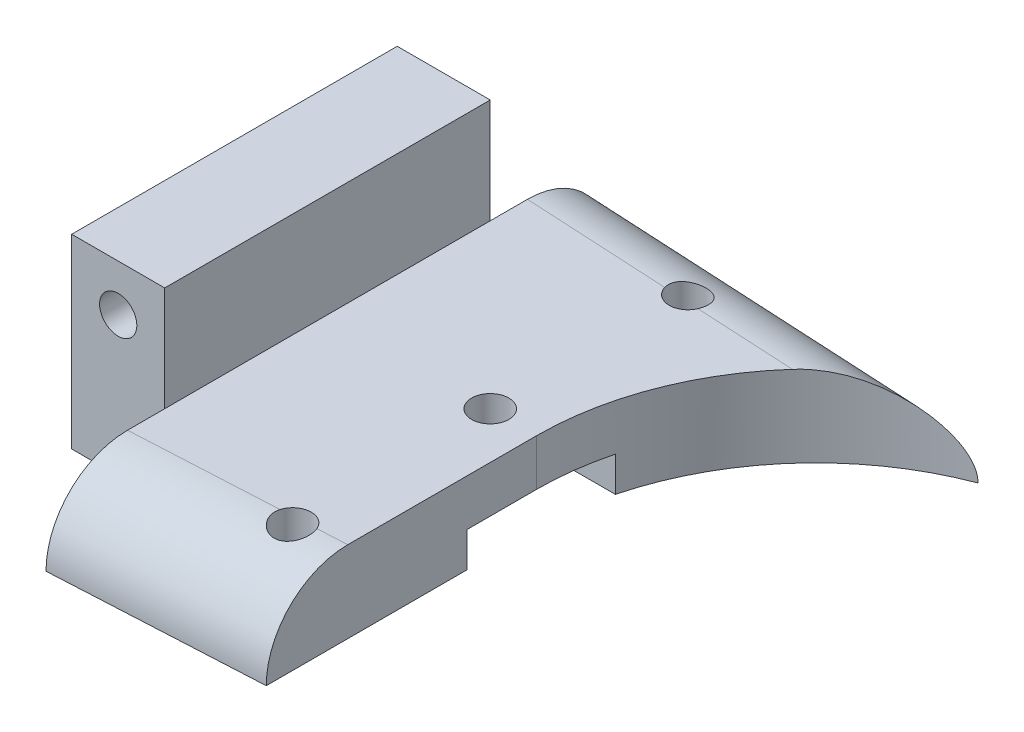
ISO-10303-21;
HEADER;
FILE_DESCRIPTION(('STEP AP214'),'2;1');
FILE_NAME('part.step','',(''),(''),'','','');
FILE_SCHEMA(('AUTOMOTIVE_DESIGN { 1 0 10303 214 1 1 1 1 }'));
ENDSEC;
DATA;
#1=APPLICATION_CONTEXT('core data for automotive mechanical design processes');
#2=APPLICATION_PROTOCOL_DEFINITION('international standard','automotive_design',2000,#1);
#3=PRODUCT_CONTEXT('',#1,'mechanical');
#4=PRODUCT('Part','Part','',(#3));
#5=PRODUCT_RELATED_PRODUCT_CATEGORY('part','',(#4));
#6=PRODUCT_DEFINITION_FORMATION('','',#4);
#7=PRODUCT_DEFINITION_CONTEXT('part definition',#1,'design');
#8=PRODUCT_DEFINITION('design','',#6,#7);
#9=PRODUCT_DEFINITION_SHAPE('','',#8);
#10=(LENGTH_UNIT() NAMED_UNIT(*) SI_UNIT(.MILLI.,.METRE.));
#11=(NAMED_UNIT(*) PLANE_ANGLE_UNIT() SI_UNIT($,.RADIAN.));
#12=(NAMED_UNIT(*) SI_UNIT($,.STERADIAN.) SOLID_ANGLE_UNIT());
#13=UNCERTAINTY_MEASURE_WITH_UNIT(LENGTH_MEASURE(1.E-05),#10,'distance_accuracy_value','');
#14=(GEOMETRIC_REPRESENTATION_CONTEXT(3) GLOBAL_UNCERTAINTY_ASSIGNED_CONTEXT((#13)) GLOBAL_UNIT_ASSIGNED_CONTEXT((#10,
#11,#12)) REPRESENTATION_CONTEXT('',''));
#15=CARTESIAN_POINT('',(0.,0.,0.));
#16=DIRECTION('',(0.,0.,1.));
#17=DIRECTION('',(1.,0.,0.));
#18=AXIS2_PLACEMENT_3D('',#15,#16,#17);
#19=CARTESIAN_POINT('',(0.,0.,0.));
#20=DIRECTION('',(0.,1.,0.));
#21=DIRECTION('',(0.,0.,1.));
#22=AXIS2_PLACEMENT_3D('',#19,#20,#21);
#23=PLANE('',#22);
#24=CARTESIAN_POINT('',(24.,0.,8.5));
#25=DIRECTION('',(0.,1.,0.));
#26=DIRECTION('',(0.,0.,1.));
#27=AXIS2_PLACEMENT_3D('',#24,#25,#26);
#28=CIRCLE('',#27,0.800000000000002);
#29=CARTESIAN_POINT('',(24.,0.,9.3));
#30=VERTEX_POINT('',#29);
#31=EDGE_CURVE('E210',#30,#30,#28,.T.);
#32=ORIENTED_EDGE('',*,*,#31,.T.);
#33=EDGE_LOOP('',(#32));
#34=FACE_BOUND('',#33,.T.);
#35=DIRECTION('',(1.,0.,0.));
#36=VECTOR('',#35,1.);
#37=CARTESIAN_POINT('',(13.,0.,3.));
#38=LINE('',#37,#36);
#39=CARTESIAN_POINT('',(13.,0.,3.));
#40=VERTEX_POINT('',#39);
#41=CARTESIAN_POINT('',(26.,0.,3.));
#42=VERTEX_POINT('',#41);
#43=EDGE_CURVE('E167',#40,#42,#38,.T.);
#44=ORIENTED_EDGE('',*,*,#43,.T.);
#45=DIRECTION('',(0.,0.,1.));
#46=VECTOR('',#45,1.);
#47=CARTESIAN_POINT('',(26.,0.,0.));
#48=LINE('',#47,#46);
#49=CARTESIAN_POINT('',(26.,0.,11.6315789473684));
#50=VERTEX_POINT('',#49);
#51=EDGE_CURVE('E229',#42,#50,#48,.T.);
#52=ORIENTED_EDGE('',*,*,#51,.T.);
#53=DIRECTION('',(0.99861782933251,0.,-0.0525588331227637));
#54=VECTOR('',#53,1.);
#55=CARTESIAN_POINT('',(0.682320441988951,0.,12.9640883977901));
#56=LINE('',#55,#54);
#57=CARTESIAN_POINT('',(17.,0.,12.1052631578947));
#58=VERTEX_POINT('',#57);
#59=EDGE_CURVE('E256',#58,#50,#56,.T.);
#60=ORIENTED_EDGE('',*,*,#59,.F.);
#61=DIRECTION('',(0.,0.,1.));
#62=VECTOR('',#61,1.);
#63=CARTESIAN_POINT('',(17.,0.,0.));
#64=LINE('',#63,#62);
#65=CARTESIAN_POINT('',(17.,0.,7.));
#66=VERTEX_POINT('',#65);
#67=EDGE_CURVE('E254',#66,#58,#64,.T.);
#68=ORIENTED_EDGE('',*,*,#67,.F.);
#69=DIRECTION('',(1.,0.,0.));
#70=VECTOR('',#69,1.);
#71=CARTESIAN_POINT('',(0.,0.,7.));
#72=LINE('',#71,#70);
#73=CARTESIAN_POINT('',(13.,0.,7.));
#74=VERTEX_POINT('',#73);
#75=EDGE_CURVE('E252',#74,#66,#72,.T.);
#76=ORIENTED_EDGE('',*,*,#75,.F.);
#77=DIRECTION('',(0.,0.,-1.));
#78=VECTOR('',#77,1.);
#79=CARTESIAN_POINT('',(13.,0.,0.));
#80=LINE('',#79,#78);
#81=EDGE_CURVE('E250',#74,#40,#80,.T.);
#82=ORIENTED_EDGE('',*,*,#81,.T.);
#83=EDGE_LOOP('',(#44,#52,#60,#68,#76,#82));
#84=FACE_BOUND('',#83,.T.);
#85=ADVANCED_FACE('F35',(#34,#84),#23,.F.);
#86=CARTESIAN_POINT('',(24.,0.,-8.5));
#87=DIRECTION('',(0.,1.,0.));
#88=DIRECTION('',(0.,0.,1.));
#89=AXIS2_PLACEMENT_3D('',#86,#87,#88);
#90=CIRCLE('',#89,0.799999999999999);
#91=CARTESIAN_POINT('',(24.,0.,-7.7));
#92=VERTEX_POINT('',#91);
#93=EDGE_CURVE('E214',#92,#92,#90,.T.);
#94=ORIENTED_EDGE('',*,*,#93,.T.);
#95=EDGE_LOOP('',(#94));
#96=FACE_BOUND('',#95,.T.);
#97=DIRECTION('',(-1.,0.,0.));
#98=VECTOR('',#97,1.);
#99=CARTESIAN_POINT('',(26.3810499613777,0.,-3.));
#100=LINE('',#99,#98);
#101=CARTESIAN_POINT('',(26.3810499613777,0.,-3.));
#102=VERTEX_POINT('',#101);
#103=CARTESIAN_POINT('',(13.,0.,-3.));
#104=VERTEX_POINT('',#103);
#105=EDGE_CURVE('E178',#102,#104,#100,.T.);
#106=ORIENTED_EDGE('',*,*,#105,.T.);
#107=CARTESIAN_POINT('',(13.,0.,-7.));
#108=VERTEX_POINT('',#107);
#109=EDGE_CURVE('E249',#104,#108,#80,.T.);
#110=ORIENTED_EDGE('',*,*,#109,.T.);
#111=DIRECTION('',(1.,0.,0.));
#112=VECTOR('',#111,1.);
#113=CARTESIAN_POINT('',(0.,0.,-7.));
#114=LINE('',#113,#112);
#115=CARTESIAN_POINT('',(17.,0.,-7.));
#116=VERTEX_POINT('',#115);
#117=EDGE_CURVE('E246',#108,#116,#114,.T.);
#118=ORIENTED_EDGE('',*,*,#117,.T.);
#119=DIRECTION('',(0.,0.,-1.));
#120=VECTOR('',#119,1.);
#121=CARTESIAN_POINT('',(17.,0.,0.));
#122=LINE('',#121,#120);
#123=CARTESIAN_POINT('',(17.,0.,-12.1052631578947));
#124=VERTEX_POINT('',#123);
#125=EDGE_CURVE('E243',#116,#124,#122,.T.);
#126=ORIENTED_EDGE('',*,*,#125,.T.);
#127=DIRECTION('',(0.99861782933251,0.,0.0525588331227638));
#128=VECTOR('',#127,1.);
#129=CARTESIAN_POINT('',(0.682320441988952,0.,-12.9640883977901));
#130=LINE('',#129,#128);
#131=CARTESIAN_POINT('',(33.7534704892804,0.,-11.2235015531958));
#132=VERTEX_POINT('',#131);
#133=EDGE_CURVE('E240',#124,#132,#130,.T.);
#134=ORIENTED_EDGE('',*,*,#133,.T.);
#135=CARTESIAN_POINT('',(38.,0.,0.));
#136=DIRECTION('',(0.,1.,0.));
#137=DIRECTION('',(0.,0.,1.));
#138=AXIS2_PLACEMENT_3D('',#135,#136,#137);
#139=CIRCLE('',#138,12.);
#140=EDGE_CURVE('E225',#132,#102,#139,.T.);
#141=ORIENTED_EDGE('',*,*,#140,.T.);
#142=EDGE_LOOP('',(#106,#110,#118,#126,#134,#141));
#143=FACE_BOUND('',#142,.T.);
#144=ADVANCED_FACE('F310',(#96,#143),#23,.F.);
#145=CARTESIAN_POINT('',(38.,3.5,0.));
#146=DIRECTION('',(0.,-1.,0.));
#147=DIRECTION('',(0.,0.,-1.));
#148=AXIS2_PLACEMENT_3D('',#145,#146,#147);
#149=CYLINDRICAL_SURFACE('',#148,12.);
#150=ORIENTED_EDGE('',*,*,#140,.F.);
#151=CARTESIAN_POINT('',(33.7534704892804,0.,-11.2235015531958));
#152=CARTESIAN_POINT('',(33.7534922223396,0.0459976707980731,-11.223507496215));
#153=CARTESIAN_POINT('',(33.7513620311404,0.0919644644184699,-11.2227039477239));
#154=CARTESIAN_POINT('',(33.7430001832694,0.183391628511297,-11.2195358223461));
#155=CARTESIAN_POINT('',(33.7367756221301,0.228852736982401,-11.2171739460158));
#156=CARTESIAN_POINT('',(33.7125118861938,0.362615630023506,-11.2079323767852));
#157=CARTESIAN_POINT('',(33.6888687602591,0.449782994604667,-11.1988925796228));
#158=CARTESIAN_POINT('',(33.6196147247928,0.647131222540702,-11.1720177888144));
#159=CARTESIAN_POINT('',(33.5693163488751,0.75534350737467,-11.1522591024798));
#160=CARTESIAN_POINT('',(33.4540794513403,0.962712226317637,-11.105786119718));
#161=CARTESIAN_POINT('',(33.3890358571261,1.06179611248434,-11.0790216783754));
#162=CARTESIAN_POINT('',(33.2543783586815,1.24470599498036,-11.0219811611271));
#163=CARTESIAN_POINT('',(33.1853808895231,1.3291119996598,-10.9920702420268));
#164=CARTESIAN_POINT('',(33.0418283672368,1.49142333764255,-10.9280702936193));
#165=CARTESIAN_POINT('',(32.9672684605031,1.56932286497448,-10.8939775983197));
#166=CARTESIAN_POINT('',(32.8142462645634,1.71953552368565,-10.8219741127302));
#167=CARTESIAN_POINT('',(32.7357780760034,1.79183976169255,-10.7840574561725));
#168=CARTESIAN_POINT('',(32.5761748192536,1.93139937554551,-10.7046756173265));
#169=CARTESIAN_POINT('',(32.4950389027797,1.99865312266991,-10.6632092994626));
#170=CARTESIAN_POINT('',(32.267045552451,2.17917043788764,-10.5432617422873));
#171=CARTESIAN_POINT('',(32.1181940197759,2.28749590393341,-10.4610940503794));
#172=CARTESIAN_POINT('',(31.8176730622243,2.49117569078273,-10.2863563237622));
#173=CARTESIAN_POINT('',(31.6660019148743,2.58652176546781,-10.1937797435954));
#174=CARTESIAN_POINT('',(31.3621163651783,2.76440667407067,-9.99855258236422));
#175=CARTESIAN_POINT('',(31.2099034699057,2.84696868244288,-9.89592079398536));
#176=CARTESIAN_POINT('',(30.9061958090925,2.99913401581841,-9.68052680941791));
#177=CARTESIAN_POINT('',(30.7547009181428,3.068739691719,-9.56776645655017));
#178=CARTESIAN_POINT('',(30.4667709450306,3.1886444207106,-9.34242603000025));
#179=CARTESIAN_POINT('',(30.33016707132,3.24009292353693,-9.23067468597348));
#180=CARTESIAN_POINT('',(30.0597246208965,3.33029782270775,-8.99909543367471));
#181=CARTESIAN_POINT('',(29.9258847536574,3.36906027376892,-8.87927141130401));
#182=CARTESIAN_POINT('',(29.6615570097183,3.43263397713585,-8.63152331355712));
#183=CARTESIAN_POINT('',(29.5310809719973,3.45740106039998,-8.50357499573499));
#184=CARTESIAN_POINT('',(29.2749234869763,3.49107905341261,-8.24057378300906));
#185=CARTESIAN_POINT('',(29.149250577721,3.49996290515638,-8.10550916715288));
#186=CARTESIAN_POINT('',(29.0267068065038,3.50000000000001,-7.96743429615551));
#187=B_SPLINE_CURVE_WITH_KNOTS('',3,(#151,#152,#153,#154,#155,#156,#157,#158,#159,#160,#161,
#162,#163,#164,#165,#166,#167,#168,#169,#170,#171,#172,#173,#174,#175,#176,#177,#178,#179,#180,
#181,#182,#183,#184,#185,#186),.UNSPECIFIED.,.F.,.F.,(4,2,2,2,2,2,2,2,2,2,2,2,2,2,2,2,2,4),(0.,
0.137881886343804,0.275525451061734,0.546426402882972,0.907275207364903,1.27078104723187,
1.60943616624324,1.94839032119323,2.28787260607916,2.62746390386205,3.23140845879229,
3.83573494105572,4.43895276465441,5.04206102881879,5.59298100180909,6.1436376505235,
6.69602258894084,7.24934765367274),.UNSPECIFIED.);
#188=CARTESIAN_POINT('',(29.0267068065038,3.5,-7.96743429615551));
#189=VERTEX_POINT('',#188);
#190=EDGE_CURVE('E51',#132,#189,#187,.T.);
#191=ORIENTED_EDGE('',*,*,#190,.T.);
#192=CARTESIAN_POINT('',(38.,3.5,0.));
#193=DIRECTION('',(0.,1.,0.));
#194=DIRECTION('',(0.,0.,1.));
#195=AXIS2_PLACEMENT_3D('',#192,#193,#194);
#196=CIRCLE('',#195,12.);
#197=CARTESIAN_POINT('',(26.,3.5,0.));
#198=VERTEX_POINT('',#197);
#199=EDGE_CURVE('E226',#189,#198,#196,.T.);
#200=ORIENTED_EDGE('',*,*,#199,.T.);
#201=DIRECTION('',(0.,-1.,0.));
#202=VECTOR('',#201,1.);
#203=CARTESIAN_POINT('',(26.,3.5,0.));
#204=LINE('',#203,#202);
#205=CARTESIAN_POINT('',(26.,1.5,0.));
#206=VERTEX_POINT('',#205);
#207=EDGE_CURVE('E237',#198,#206,#204,.T.);
#208=ORIENTED_EDGE('',*,*,#207,.T.);
#209=CARTESIAN_POINT('',(38.,1.5,0.));
#210=DIRECTION('',(0.,1.,0.));
#211=DIRECTION('',(0.,0.,1.));
#212=AXIS2_PLACEMENT_3D('',#209,#210,#211);
#213=CIRCLE('',#212,12.);
#214=CARTESIAN_POINT('',(26.3810499613777,1.5,-3.));
#215=VERTEX_POINT('',#214);
#216=EDGE_CURVE('E191',#215,#206,#213,.T.);
#217=ORIENTED_EDGE('',*,*,#216,.F.);
#218=DIRECTION('',(0.,-1.,0.));
#219=VECTOR('',#218,1.);
#220=CARTESIAN_POINT('',(26.3810499613777,1.5,-3.));
#221=LINE('',#220,#219);
#222=EDGE_CURVE('E172',#215,#102,#221,.T.);
#223=ORIENTED_EDGE('',*,*,#222,.T.);
#224=EDGE_LOOP('',(#150,#191,#200,#208,#217,#223));
#225=FACE_BOUND('',#224,.T.);
#226=ADVANCED_FACE('F306',(#225),#149,.F.);
#227=CARTESIAN_POINT('',(13.,3.5,0.));
#228=DIRECTION('',(-1.,0.,0.));
#229=DIRECTION('',(0.,0.,1.));
#230=AXIS2_PLACEMENT_3D('',#227,#228,#229);
#231=PLANE('',#230);
#232=DIRECTION('',(0.,0.,1.));
#233=VECTOR('',#232,1.);
#234=CARTESIAN_POINT('',(13.,1.5,0.));
#235=LINE('',#234,#233);
#236=CARTESIAN_POINT('',(13.,1.5,-3.));
#237=VERTEX_POINT('',#236);
#238=CARTESIAN_POINT('',(13.,1.5,3.));
#239=VERTEX_POINT('',#238);
#240=EDGE_CURVE('E155',#237,#239,#235,.T.);
#241=ORIENTED_EDGE('',*,*,#240,.T.);
#242=DIRECTION('',(0.,-1.,0.));
#243=VECTOR('',#242,1.);
#244=CARTESIAN_POINT('',(13.,1.5,3.));
#245=LINE('',#244,#243);
#246=EDGE_CURVE('E164',#239,#40,#245,.T.);
#247=ORIENTED_EDGE('',*,*,#246,.T.);
#248=ORIENTED_EDGE('',*,*,#81,.F.);
#249=DIRECTION('',(0.,-1.,0.));
#250=VECTOR('',#249,1.);
#251=CARTESIAN_POINT('',(13.,3.5,7.));
#252=LINE('',#251,#250);
#253=CARTESIAN_POINT('',(13.,8.,7.));
#254=VERTEX_POINT('',#253);
#255=EDGE_CURVE('E266',#254,#74,#252,.T.);
#256=ORIENTED_EDGE('',*,*,#255,.F.);
#257=DIRECTION('',(0.,0.,1.));
#258=VECTOR('',#257,1.);
#259=CARTESIAN_POINT('',(13.,8.,-7.));
#260=LINE('',#259,#258);
#261=CARTESIAN_POINT('',(13.,8.,-7.));
#262=VERTEX_POINT('',#261);
#263=EDGE_CURVE('E193',#262,#254,#260,.T.);
#264=ORIENTED_EDGE('',*,*,#263,.F.);
#265=DIRECTION('',(0.,-1.,0.));
#266=VECTOR('',#265,1.);
#267=CARTESIAN_POINT('',(13.,3.5,-7.));
#268=LINE('',#267,#266);
#269=EDGE_CURVE('E268',#262,#108,#268,.T.);
#270=ORIENTED_EDGE('',*,*,#269,.T.);
#271=ORIENTED_EDGE('',*,*,#109,.F.);
#272=DIRECTION('',(0.,-1.,0.));
#273=VECTOR('',#272,1.);
#274=CARTESIAN_POINT('',(13.,1.5,-3.));
#275=LINE('',#274,#273);
#276=EDGE_CURVE('E177',#237,#104,#275,.T.);
#277=ORIENTED_EDGE('',*,*,#276,.F.);
#278=EDGE_LOOP('',(#241,#247,#248,#256,#264,#270,#271,#277));
#279=FACE_BOUND('',#278,.T.);
#280=ADVANCED_FACE('F175',(#279),#231,.T.);
#281=CARTESIAN_POINT('',(26.,3.5,0.));
#282=DIRECTION('',(1.,0.,0.));
#283=DIRECTION('',(0.,0.,-1.));
#284=AXIS2_PLACEMENT_3D('',#281,#282,#283);
#285=PLANE('',#284);
#286=DIRECTION('',(0.,0.,1.));
#287=VECTOR('',#286,1.);
#288=CARTESIAN_POINT('',(26.,3.5,0.));
#289=LINE('',#288,#287);
#290=CARTESIAN_POINT('',(26.,3.5,8.12673465439255));
#291=VERTEX_POINT('',#290);
#292=EDGE_CURVE('E235',#198,#291,#289,.T.);
#293=ORIENTED_EDGE('',*,*,#292,.T.);
#294=CARTESIAN_POINT('',(26.,0.,8.12673465439255));
#295=DIRECTION('',(1.,0.,0.));
#296=DIRECTION('',(0.,0.,1.));
#297=AXIS2_PLACEMENT_3D('',#294,#295,#296);
#298=ELLIPSE('',#297,3.50484429297587,3.5);
#299=EDGE_CURVE('E294',#291,#50,#298,.T.);
#300=ORIENTED_EDGE('',*,*,#299,.T.);
#301=ORIENTED_EDGE('',*,*,#51,.F.);
#302=DIRECTION('',(0.,1.,0.));
#303=VECTOR('',#302,1.);
#304=CARTESIAN_POINT('',(26.,3.5,3.));
#305=LINE('',#304,#303);
#306=CARTESIAN_POINT('',(26.,1.5,3.));
#307=VERTEX_POINT('',#306);
#308=EDGE_CURVE('E273',#42,#307,#305,.T.);
#309=ORIENTED_EDGE('',*,*,#308,.T.);
#310=DIRECTION('',(0.,0.,1.));
#311=VECTOR('',#310,1.);
#312=CARTESIAN_POINT('',(26.,1.5,0.));
#313=LINE('',#312,#311);
#314=EDGE_CURVE('E158',#206,#307,#313,.T.);
#315=ORIENTED_EDGE('',*,*,#314,.F.);
#316=ORIENTED_EDGE('',*,*,#207,.F.);
#317=EDGE_LOOP('',(#293,#300,#301,#309,#315,#316));
#318=FACE_BOUND('',#317,.T.);
#319=ADVANCED_FACE('F334',(#318),#285,.T.);
#320=CARTESIAN_POINT('',(0.,3.5,0.));
#321=DIRECTION('',(0.,1.,0.));
#322=DIRECTION('',(0.,0.,1.));
#323=AXIS2_PLACEMENT_3D('',#320,#321,#322);
#324=PLANE('',#323);
#325=DIRECTION('',(0.,0.,1.));
#326=VECTOR('',#325,1.);
#327=CARTESIAN_POINT('',(17.,3.5,0.));
#328=LINE('',#327,#326);
#329=CARTESIAN_POINT('',(17.,3.5,7.));
#330=VERTEX_POINT('',#329);
#331=CARTESIAN_POINT('',(17.,3.5,8.60041886491887));
#332=VERTEX_POINT('',#331);
#333=EDGE_CURVE('E232',#330,#332,#328,.T.);
#334=ORIENTED_EDGE('',*,*,#333,.T.);
#335=DIRECTION('',(0.99861782933251,0.,-0.0525588331227637));
#336=VECTOR('',#335,1.);
#337=CARTESIAN_POINT('',(25.8160440840703,3.5,8.13641654470464));
#338=LINE('',#337,#336);
#339=CARTESIAN_POINT('',(23.2330702873962,3.5,8.27236253400328));
#340=VERTEX_POINT('',#339);
#341=EDGE_CURVE('E285',#332,#340,#338,.T.);
#342=ORIENTED_EDGE('',*,*,#341,.T.);
#343=CARTESIAN_POINT('',(24.,3.5,8.5));
#344=DIRECTION('',(0.,1.,0.));
#345=DIRECTION('',(0.,0.,1.));
#346=AXIS2_PLACEMENT_3D('',#343,#344,#345);
#347=CIRCLE('',#346,0.800000000000002);
#348=CARTESIAN_POINT('',(24.7387968862693,3.5,8.19311376564153));
#349=VERTEX_POINT('',#348);
#350=EDGE_CURVE('E211',#349,#340,#347,.T.);
#351=ORIENTED_EDGE('',*,*,#350,.F.);
#352=DIRECTION('',(0.99861782933251,0.,-0.0525588331227637));
#353=VECTOR('',#352,1.);
#354=CARTESIAN_POINT('',(25.8160440840703,3.5,8.13641654470464));
#355=LINE('',#354,#353);
#356=EDGE_CURVE('E59',#349,#291,#355,.T.);
#357=ORIENTED_EDGE('',*,*,#356,.T.);
#358=ORIENTED_EDGE('',*,*,#292,.F.);
#359=ORIENTED_EDGE('',*,*,#199,.F.);
#360=DIRECTION('',(0.99861782933251,0.,0.0525588331227638));
#361=VECTOR('',#360,1.);
#362=CARTESIAN_POINT('',(0.498364526059279,3.5,-9.46892599512628));
#363=LINE('',#362,#361);
#364=CARTESIAN_POINT('',(24.7387968862693,3.5,-8.19311376564153));
#365=VERTEX_POINT('',#364);
#366=EDGE_CURVE('E282',#189,#365,#363,.F.);
#367=ORIENTED_EDGE('',*,*,#366,.T.);
#368=CARTESIAN_POINT('',(24.,3.5,-8.5));
#369=DIRECTION('',(0.,1.,0.));
#370=DIRECTION('',(0.,0.,1.));
#371=AXIS2_PLACEMENT_3D('',#368,#369,#370);
#372=CIRCLE('',#371,0.799999999999999);
#373=CARTESIAN_POINT('',(23.2330702873962,3.5,-8.27236253400328));
#374=VERTEX_POINT('',#373);
#375=EDGE_CURVE('E217',#374,#365,#372,.T.);
#376=ORIENTED_EDGE('',*,*,#375,.F.);
#377=DIRECTION('',(0.99861782933251,0.,0.0525588331227638));
#378=VECTOR('',#377,1.);
#379=CARTESIAN_POINT('',(0.498364526059279,3.5,-9.46892599512628));
#380=LINE('',#379,#378);
#381=CARTESIAN_POINT('',(17.,3.5,-8.60041886491887));
#382=VERTEX_POINT('',#381);
#383=EDGE_CURVE('E277',#374,#382,#380,.F.);
#384=ORIENTED_EDGE('',*,*,#383,.T.);
#385=DIRECTION('',(0.,0.,-1.));
#386=VECTOR('',#385,1.);
#387=CARTESIAN_POINT('',(17.,3.5,0.));
#388=LINE('',#387,#386);
#389=CARTESIAN_POINT('',(17.,3.5,-7.));
#390=VERTEX_POINT('',#389);
#391=EDGE_CURVE('E228',#390,#382,#388,.T.);
#392=ORIENTED_EDGE('',*,*,#391,.F.);
#393=DIRECTION('',(0.,0.,1.));
#394=VECTOR('',#393,1.);
#395=CARTESIAN_POINT('',(17.,3.5,0.));
#396=LINE('',#395,#394);
#397=EDGE_CURVE('E207',#390,#330,#396,.T.);
#398=ORIENTED_EDGE('',*,*,#397,.T.);
#399=EDGE_LOOP('',(#334,#342,#351,#357,#358,#359,#367,#376,#384,#392,#398));
#400=FACE_BOUND('',#399,.T.);
#401=CARTESIAN_POINT('',(24.,3.5,0.));
#402=DIRECTION('',(0.,1.,0.));
#403=DIRECTION('',(0.,0.,1.));
#404=AXIS2_PLACEMENT_3D('',#401,#402,#403);
#405=CIRCLE('',#404,0.799999999999999);
#406=CARTESIAN_POINT('',(24.,3.5,0.799999999999999));
#407=VERTEX_POINT('',#406);
#408=EDGE_CURVE('E220',#407,#407,#405,.T.);
#409=ORIENTED_EDGE('',*,*,#408,.F.);
#410=EDGE_LOOP('',(#409));
#411=FACE_BOUND('',#410,.T.);
#412=ADVANCED_FACE('F331',(#400,#411),#324,.T.);
#413=CARTESIAN_POINT('',(17.,3.5,0.));
#414=DIRECTION('',(-1.,0.,0.));
#415=DIRECTION('',(0.,0.,1.));
#416=AXIS2_PLACEMENT_3D('',#413,#414,#415);
#417=PLANE('',#416);
#418=ORIENTED_EDGE('',*,*,#391,.T.);
#419=CARTESIAN_POINT('',(17.,0.,-8.60041886491887));
#420=DIRECTION('',(-1.,0.,0.));
#421=DIRECTION('',(0.,0.,1.));
#422=AXIS2_PLACEMENT_3D('',#419,#420,#421);
#423=ELLIPSE('',#422,3.50484429297587,3.5);
#424=EDGE_CURVE('E11',#382,#124,#423,.T.);
#425=ORIENTED_EDGE('',*,*,#424,.T.);
#426=ORIENTED_EDGE('',*,*,#125,.F.);
#427=DIRECTION('',(0.,-1.,0.));
#428=VECTOR('',#427,1.);
#429=CARTESIAN_POINT('',(17.,3.5,-7.));
#430=LINE('',#429,#428);
#431=EDGE_CURVE('E271',#390,#116,#430,.T.);
#432=ORIENTED_EDGE('',*,*,#431,.F.);
#433=EDGE_LOOP('',(#418,#425,#426,#432));
#434=FACE_BOUND('',#433,.T.);
#435=ADVANCED_FACE('F311',(#434),#417,.T.);
#436=CARTESIAN_POINT('',(0.,3.5,-7.));
#437=DIRECTION('',(0.,0.,-1.));
#438=DIRECTION('',(-1.,0.,0.));
#439=AXIS2_PLACEMENT_3D('',#436,#437,#438);
#440=PLANE('',#439);
#441=CARTESIAN_POINT('',(15.,6.,-7.));
#442=DIRECTION('',(0.,0.,-1.));
#443=DIRECTION('',(-1.,0.,0.));
#444=AXIS2_PLACEMENT_3D('',#441,#442,#443);
#445=CIRCLE('',#444,0.800000000000001);
#446=CARTESIAN_POINT('',(14.2,6.,-7.));
#447=VERTEX_POINT('',#446);
#448=EDGE_CURVE('E183',#447,#447,#445,.T.);
#449=ORIENTED_EDGE('',*,*,#448,.F.);
#450=EDGE_LOOP('',(#449));
#451=FACE_BOUND('',#450,.T.);
#452=ORIENTED_EDGE('',*,*,#117,.F.);
#453=ORIENTED_EDGE('',*,*,#269,.F.);
#454=DIRECTION('',(-1.,0.,0.));
#455=VECTOR('',#454,1.);
#456=CARTESIAN_POINT('',(13.,8.,-7.));
#457=LINE('',#456,#455);
#458=CARTESIAN_POINT('',(17.,8.,-7.));
#459=VERTEX_POINT('',#458);
#460=EDGE_CURVE('E200',#459,#262,#457,.T.);
#461=ORIENTED_EDGE('',*,*,#460,.F.);
#462=DIRECTION('',(0.,-1.,0.));
#463=VECTOR('',#462,1.);
#464=CARTESIAN_POINT('',(17.,8.,-7.));
#465=LINE('',#464,#463);
#466=EDGE_CURVE('E203',#459,#390,#465,.T.);
#467=ORIENTED_EDGE('',*,*,#466,.T.);
#468=ORIENTED_EDGE('',*,*,#431,.T.);
#469=EDGE_LOOP('',(#452,#453,#461,#467,#468));
#470=FACE_BOUND('',#469,.T.);
#471=ADVANCED_FACE('F347',(#451,#470),#440,.T.);
#472=CARTESIAN_POINT('',(0.,3.5,7.));
#473=DIRECTION('',(0.,0.,-1.));
#474=DIRECTION('',(-1.,0.,0.));
#475=AXIS2_PLACEMENT_3D('',#472,#473,#474);
#476=PLANE('',#475);
#477=CARTESIAN_POINT('',(15.,6.,7.));
#478=DIRECTION('',(0.,0.,-1.));
#479=DIRECTION('',(-1.,0.,0.));
#480=AXIS2_PLACEMENT_3D('',#477,#478,#479);
#481=CIRCLE('',#480,0.800000000000001);
#482=CARTESIAN_POINT('',(14.2,6.,7.));
#483=VERTEX_POINT('',#482);
#484=EDGE_CURVE('E278',#483,#483,#481,.T.);
#485=ORIENTED_EDGE('',*,*,#484,.T.);
#486=EDGE_LOOP('',(#485));
#487=FACE_BOUND('',#486,.T.);
#488=ORIENTED_EDGE('',*,*,#75,.T.);
#489=DIRECTION('',(0.,-1.,0.));
#490=VECTOR('',#489,1.);
#491=CARTESIAN_POINT('',(17.,3.5,7.));
#492=LINE('',#491,#490);
#493=EDGE_CURVE('E263',#330,#66,#492,.T.);
#494=ORIENTED_EDGE('',*,*,#493,.F.);
#495=DIRECTION('',(0.,-1.,0.));
#496=VECTOR('',#495,1.);
#497=CARTESIAN_POINT('',(17.,8.,7.));
#498=LINE('',#497,#496);
#499=CARTESIAN_POINT('',(17.,8.,7.));
#500=VERTEX_POINT('',#499);
#501=EDGE_CURVE('E205',#500,#330,#498,.T.);
#502=ORIENTED_EDGE('',*,*,#501,.F.);
#503=DIRECTION('',(1.,0.,0.));
#504=VECTOR('',#503,1.);
#505=CARTESIAN_POINT('',(13.,8.,7.));
#506=LINE('',#505,#504);
#507=EDGE_CURVE('E196',#254,#500,#506,.T.);
#508=ORIENTED_EDGE('',*,*,#507,.F.);
#509=ORIENTED_EDGE('',*,*,#255,.T.);
#510=EDGE_LOOP('',(#488,#494,#502,#508,#509));
#511=FACE_BOUND('',#510,.T.);
#512=ADVANCED_FACE('F343',(#487,#511),#476,.F.);
#513=CARTESIAN_POINT('',(17.,3.5,0.));
#514=DIRECTION('',(1.,0.,0.));
#515=DIRECTION('',(0.,0.,-1.));
#516=AXIS2_PLACEMENT_3D('',#513,#514,#515);
#517=PLANE('',#516);
#518=ORIENTED_EDGE('',*,*,#67,.T.);
#519=CARTESIAN_POINT('',(17.,0.,8.60041886491887));
#520=DIRECTION('',(1.,0.,0.));
#521=DIRECTION('',(0.,0.,1.));
#522=AXIS2_PLACEMENT_3D('',#519,#520,#521);
#523=ELLIPSE('',#522,3.50484429297587,3.5);
#524=EDGE_CURVE('E317',#58,#332,#523,.F.);
#525=ORIENTED_EDGE('',*,*,#524,.T.);
#526=ORIENTED_EDGE('',*,*,#333,.F.);
#527=ORIENTED_EDGE('',*,*,#493,.T.);
#528=EDGE_LOOP('',(#518,#525,#526,#527));
#529=FACE_BOUND('',#528,.T.);
#530=ADVANCED_FACE('F329',(#529),#517,.F.);
#531=CARTESIAN_POINT('',(24.,3.5,0.));
#532=DIRECTION('',(0.,-1.,0.));
#533=DIRECTION('',(0.,0.,-1.));
#534=AXIS2_PLACEMENT_3D('',#531,#532,#533);
#535=CYLINDRICAL_SURFACE('',#534,0.799999999999999);
#536=CARTESIAN_POINT('',(24.,1.5,0.));
#537=DIRECTION('',(0.,1.,0.));
#538=DIRECTION('',(0.,0.,1.));
#539=AXIS2_PLACEMENT_3D('',#536,#537,#538);
#540=CIRCLE('',#539,0.799999999999999);
#541=CARTESIAN_POINT('',(24.,1.5,0.799999999999999));
#542=VERTEX_POINT('',#541);
#543=EDGE_CURVE('E171',#542,#542,#540,.T.);
#544=ORIENTED_EDGE('',*,*,#543,.F.);
#545=EDGE_LOOP('',(#544));
#546=FACE_BOUND('',#545,.T.);
#547=ORIENTED_EDGE('',*,*,#408,.T.);
#548=EDGE_LOOP('',(#547));
#549=FACE_BOUND('',#548,.T.);
#550=ADVANCED_FACE('F325',(#546,#549),#535,.F.);
#551=CARTESIAN_POINT('',(24.,3.5,-8.5));
#552=DIRECTION('',(0.,-1.,0.));
#553=DIRECTION('',(0.,0.,-1.));
#554=AXIS2_PLACEMENT_3D('',#551,#552,#553);
#555=CYLINDRICAL_SURFACE('',#554,0.799999999999999);
#556=ORIENTED_EDGE('',*,*,#375,.T.);
#557=CARTESIAN_POINT('',(24.7387968862693,3.5,-8.19311376564153));
#558=CARTESIAN_POINT('',(24.7557721164615,3.50003159754214,-8.23386829457214));
#559=CARTESIAN_POINT('',(24.7692909783366,3.49926027382538,-8.27604479669835));
#560=CARTESIAN_POINT('',(24.7892112035885,3.4960702089167,-8.36191789393485));
#561=CARTESIAN_POINT('',(24.7956238114712,3.49365408017397,-8.40561197438765));
#562=CARTESIAN_POINT('',(24.8011828334097,3.4871319268166,-8.49335068997491));
#563=CARTESIAN_POINT('',(24.8003263968706,3.48302523984121,-8.53739545586746));
#564=CARTESIAN_POINT('',(24.7914536015336,3.47330577832524,-8.62458120001664));
#565=CARTESIAN_POINT('',(24.783437177626,3.46769299008921,-8.66772217005092));
#566=CARTESIAN_POINT('',(24.7604200123523,3.45522582751165,-8.75240304805569));
#567=CARTESIAN_POINT('',(24.7453468082676,3.44835903348009,-8.79392138446435));
#568=CARTESIAN_POINT('',(24.7086518021346,3.43389447507147,-8.87382710227918));
#569=CARTESIAN_POINT('',(24.6870278130323,3.4262964671493,-8.91221343258832));
#570=CARTESIAN_POINT('',(24.6370627458591,3.41069965225589,-8.9859991905963));
#571=CARTESIAN_POINT('',(24.6085393805137,3.40269566193568,-9.02127423285752));
#572=CARTESIAN_POINT('',(24.5458845503418,3.38717619146531,-9.08656392674818));
#573=CARTESIAN_POINT('',(24.5117529294215,3.37966072492029,-9.11657843191377));
#574=CARTESIAN_POINT('',(24.4385119654286,3.36575124334898,-9.17066540811557));
#575=CARTESIAN_POINT('',(24.3993726323854,3.3593645877463,-9.19469927389988));
#576=CARTESIAN_POINT('',(24.317354331776,3.34840777383612,-9.23579101254548));
#577=CARTESIAN_POINT('',(24.2744763440676,3.34383714130476,-9.25285070662803));
#578=CARTESIAN_POINT('',(24.187822861123,3.33712345901326,-9.27890714262235));
#579=CARTESIAN_POINT('',(24.1441332696645,3.33489998738933,-9.28816862902808));
#580=CARTESIAN_POINT('',(24.0557714376773,3.33283374269759,-9.29929416061246));
#581=CARTESIAN_POINT('',(24.0110994370105,3.33299039481099,-9.30115999176333));
#582=CARTESIAN_POINT('',(23.9236914577196,3.33561876140236,-9.29751135944002));
#583=CARTESIAN_POINT('',(23.8809420908325,3.33800994941367,-9.2922507617067));
#584=CARTESIAN_POINT('',(23.7969877662006,3.3447562979514,-9.27499868336523));
#585=CARTESIAN_POINT('',(23.7557829269516,3.3491116088321,-9.26300668744907));
#586=CARTESIAN_POINT('',(23.6754885163773,3.35944578089292,-9.23250263160541));
#587=CARTESIAN_POINT('',(23.6364317792885,3.36544423432291,-9.2139110333778));
#588=CARTESIAN_POINT('',(23.5619435483396,3.37851080788759,-9.17079033697788));
#589=CARTESIAN_POINT('',(23.5265128459568,3.38557916072478,-9.14625994642421));
#590=CARTESIAN_POINT('',(23.4586805695762,3.40052174437248,-9.09074082344723));
#591=CARTESIAN_POINT('',(23.4264722348602,3.40841747485743,-9.05952155453767));
#592=CARTESIAN_POINT('',(23.3676971286093,3.42409719615052,-8.99213070553938));
#593=CARTESIAN_POINT('',(23.3411311466658,3.43188117117766,-8.95595843349038));
#594=CARTESIAN_POINT('',(23.2938846914055,3.44688821134773,-8.87879843866051));
#595=CARTESIAN_POINT('',(23.2733341885767,3.45409673933511,-8.8377280863329));
#596=CARTESIAN_POINT('',(23.2395074237068,3.46723463376616,-8.75249215208243));
#597=CARTESIAN_POINT('',(23.2262312313447,3.4731639879566,-8.70832654051539));
#598=CARTESIAN_POINT('',(23.2076293027716,3.483251843394,-8.61909975905979));
#599=CARTESIAN_POINT('',(23.2021488677062,3.48744359665504,-8.57407452636002));
#600=CARTESIAN_POINT('',(23.198892311112,3.49403654820066,-8.48363768786465));
#601=CARTESIAN_POINT('',(23.2011072583738,3.49643981825446,-8.43822659094864));
#602=CARTESIAN_POINT('',(23.2098936622468,3.49865481313432,-8.37287416261995));
#603=CARTESIAN_POINT('',(23.2134417510779,3.49916513126948,-8.35250878729113));
#604=CARTESIAN_POINT('',(23.2220958820348,3.49983763099566,-8.31214436749858));
#605=CARTESIAN_POINT('',(23.2271990982002,3.50000043981647,-8.29214472773076));
#606=CARTESIAN_POINT('',(23.2330702873961,3.50000000000001,-8.27236253400328));
#607=B_SPLINE_CURVE_WITH_KNOTS('',3,(#557,#558,#559,#560,#561,#562,#563,#564,#565,#566,#567,
#568,#569,#570,#571,#572,#573,#574,#575,#576,#577,#578,#579,#580,#581,#582,#583,#584,#585,#586,
#587,#588,#589,#590,#591,#592,#593,#594,#595,#596,#597,#598,#599,#600,#601,#602,#603,#604,#605,
#606),.UNSPECIFIED.,.F.,.F.,(4,2,2,2,2,2,2,2,2,2,2,2,2,2,2,2,2,2,2,2,2,2,2,2,4),(0.,
0.132264349054726,0.264319110842768,0.396425661007378,0.52853341249952,0.662028512386435,
0.795568230338788,0.933119960684727,1.07067552013689,1.2090972260623,1.34748276169457,
1.48095542557509,1.61439585525994,1.74320560489138,1.87202521662733,2.00245323556396,
2.13290966339067,2.26892138187441,2.40495212132571,2.54373543576702,2.68252007955731,
2.81851031643925,2.95434277670842,3.01632365492034,3.07819256708784),.UNSPECIFIED.);
#608=EDGE_CURVE('E44',#365,#374,#607,.T.);
#609=ORIENTED_EDGE('',*,*,#608,.T.);
#610=EDGE_LOOP('',(#556,#609));
#611=FACE_BOUND('',#610,.T.);
#612=ORIENTED_EDGE('',*,*,#93,.F.);
#613=EDGE_LOOP('',(#612));
#614=FACE_BOUND('',#613,.T.);
#615=ADVANCED_FACE('F321',(#611,#614),#555,.F.);
#616=CARTESIAN_POINT('',(24.,3.5,8.5));
#617=DIRECTION('',(0.,-1.,0.));
#618=DIRECTION('',(0.,0.,-1.));
#619=AXIS2_PLACEMENT_3D('',#616,#617,#618);
#620=CYLINDRICAL_SURFACE('',#619,0.800000000000002);
#621=ORIENTED_EDGE('',*,*,#350,.T.);
#622=CARTESIAN_POINT('',(23.2330702873962,3.5,8.27236253400328));
#623=CARTESIAN_POINT('',(23.2204669427282,3.50003159754214,8.31467383003178));
#624=CARTESIAN_POINT('',(23.2114501383242,3.49926027382538,8.3580364198569));
#625=CARTESIAN_POINT('',(23.2006542725902,3.4960702089167,8.44552615346108));
#626=CARTESIAN_POINT('',(23.1988637649091,3.49365408017397,8.48965197683829));
#627=CARTESIAN_POINT('',(23.2025455972142,3.4871319268166,8.57748949187993));
#628=CARTESIAN_POINT('',(23.2080207857722,3.48302523984121,8.62120101434633));
#629=CARTESIAN_POINT('',(23.2259966548303,3.47330577832524,8.70697367089576));
#630=CARTESIAN_POINT('',(23.2384973992171,3.46769299008921,8.74903478996717));
#631=CARTESIAN_POINT('',(23.2702765507715,3.45522582751165,8.83083165129679));
#632=CARTESIAN_POINT('',(23.2896247558931,3.44835903348009,8.87053833458932));
#633=CARTESIAN_POINT('',(23.3345049202159,3.43389447507147,8.94615062238017));
#634=CARTESIAN_POINT('',(23.3600389440518,3.4262964671493,8.98205495200835));
#635=CARTESIAN_POINT('',(23.4174734274403,3.41069965225589,9.05018810209203));
#636=CARTESIAN_POINT('',(23.4495421101205,3.40269566193568,9.08227408919401));
#637=CARTESIAN_POINT('',(23.5187043952856,3.38717619146531,9.1406260401722));
#638=CARTESIAN_POINT('',(23.555798137627,3.37966072492029,9.16689184200823));
#639=CARTESIAN_POINT('',(23.6343120937959,3.36575124334898,9.21299171714887));
#640=CARTESIAN_POINT('',(23.6757580794184,3.3593645877463,9.23278425037183));
#641=CARTESIAN_POINT('',(23.7616367376723,3.34840777383612,9.26503930697199));
#642=CARTESIAN_POINT('',(23.8060686270374,3.34383714130475,9.27750374436647));
#643=CARTESIAN_POINT('',(23.8949785674457,3.33712345901326,9.29432000018432));
#644=CARTESIAN_POINT('',(23.9393989801764,3.33489998738933,9.29894411794852));
#645=CARTESIAN_POINT('',(24.0284404987278,3.33283374269759,9.30073263108349));
#646=CARTESIAN_POINT('',(24.0730615534896,3.33299039481099,9.29789882773811));
#647=CARTESIAN_POINT('',(24.1596036101649,3.33561876140236,9.28509493036396));
#648=CARTESIAN_POINT('',(24.2015645752629,3.33800994941367,9.2753758941051));
#649=CARTESIAN_POINT('',(24.2832440721979,3.3447562979514,9.24940624620749));
#650=CARTESIAN_POINT('',(24.3229624321008,3.3491116088321,9.23315513454648));
#651=CARTESIAN_POINT('',(24.3996111439369,3.35944578089292,9.19439091436544));
#652=CARTESIAN_POINT('',(24.436500493714,3.36544423432291,9.17180215367119));
#653=CARTESIAN_POINT('',(24.5060507055329,3.37851080788759,9.12110048659929));
#654=CARTESIAN_POINT('',(24.5387106448058,3.38557916072478,9.09298637806373));
#655=CARTESIAN_POINT('',(24.6003401829932,3.40052174437248,9.03065347537265));
#656=CARTESIAN_POINT('',(24.6290934102839,3.40841747485743,8.99622570319958));
#657=CARTESIAN_POINT('',(24.6804696146717,3.42409719615052,8.92303741679926));
#658=CARTESIAN_POINT('',(24.7030917339032,3.43188117117766,8.88427629731999));
#659=CARTESIAN_POINT('',(24.7419774910583,3.44688821134773,8.80258302815247));
#660=CARTESIAN_POINT('',(24.7581032027433,3.45409673933511,8.75958234874519));
#661=CARTESIAN_POINT('',(24.7827956608969,3.46723463376616,8.67126645538822));
#662=CARTESIAN_POINT('',(24.7913623349599,3.4731639879566,8.62595121927249));
#663=CARTESIAN_POINT('',(24.8004951432223,3.483251843394,8.53526471482554));
#664=CARTESIAN_POINT('',(24.8012188939985,3.48744359665504,8.48991294602884));
#665=CARTESIAN_POINT('',(24.7949640887805,3.49403654820066,8.39963391009262));
#666=CARTESIAN_POINT('',(24.7879944680704,3.49643981825446,8.35470621149092));
#667=CARTESIAN_POINT('',(24.7723964082063,3.49865481313432,8.2906371759905));
#668=CARTESIAN_POINT('',(24.7667301202459,3.49916513126948,8.27075676786123));
#669=CARTESIAN_POINT('',(24.7538866531283,3.49983763099566,8.23152380059892));
#670=CARTESIAN_POINT('',(24.7467122218279,3.50000043981647,8.21217035280298));
#671=CARTESIAN_POINT('',(24.7387968862694,3.50000000000001,8.19311376564153));
#672=B_SPLINE_CURVE_WITH_KNOTS('',3,(#622,#623,#624,#625,#626,#627,#628,#629,#630,#631,#632,
#633,#634,#635,#636,#637,#638,#639,#640,#641,#642,#643,#644,#645,#646,#647,#648,#649,#650,#651,
#652,#653,#654,#655,#656,#657,#658,#659,#660,#661,#662,#663,#664,#665,#666,#667,#668,#669,#670,
#671),.UNSPECIFIED.,.F.,.F.,(4,2,2,2,2,2,2,2,2,2,2,2,2,2,2,2,2,2,2,2,2,2,2,2,4),(0.,
0.132264349054725,0.264319110842769,0.396425661007379,0.528533412499521,0.662028512386435,
0.795568230338791,0.93311996068473,1.07067552013689,1.20909722606231,1.34748276169458,
1.4809554255751,1.61439585525995,1.74320560489139,1.87202521662733,2.00245323556397,
2.13290966339068,2.26892138187442,2.40495212132572,2.54373543576703,2.68252007955732,
2.81851031643926,2.95434277670843,3.01632365492036,3.07819256708785),.UNSPECIFIED.);
#673=EDGE_CURVE('E288',#340,#349,#672,.T.);
#674=ORIENTED_EDGE('',*,*,#673,.T.);
#675=EDGE_LOOP('',(#621,#674));
#676=FACE_BOUND('',#675,.T.);
#677=ORIENTED_EDGE('',*,*,#31,.F.);
#678=EDGE_LOOP('',(#677));
#679=FACE_BOUND('',#678,.T.);
#680=ADVANCED_FACE('F296',(#676,#679),#620,.F.);
#681=CARTESIAN_POINT('',(17.,8.,-7.));
#682=DIRECTION('',(-1.,0.,0.));
#683=DIRECTION('',(0.,0.,1.));
#684=AXIS2_PLACEMENT_3D('',#681,#682,#683);
#685=PLANE('',#684);
#686=ORIENTED_EDGE('',*,*,#397,.F.);
#687=ORIENTED_EDGE('',*,*,#466,.F.);
#688=DIRECTION('',(0.,0.,-1.));
#689=VECTOR('',#688,1.);
#690=CARTESIAN_POINT('',(17.,8.,-7.));
#691=LINE('',#690,#689);
#692=EDGE_CURVE('E198',#500,#459,#691,.T.);
#693=ORIENTED_EDGE('',*,*,#692,.F.);
#694=ORIENTED_EDGE('',*,*,#501,.T.);
#695=EDGE_LOOP('',(#686,#687,#693,#694));
#696=FACE_BOUND('',#695,.T.);
#697=ADVANCED_FACE('F374',(#696),#685,.F.);
#698=CARTESIAN_POINT('',(0.,8.,0.));
#699=DIRECTION('',(0.,1.,0.));
#700=DIRECTION('',(0.,0.,1.));
#701=AXIS2_PLACEMENT_3D('',#698,#699,#700);
#702=PLANE('',#701);
#703=ORIENTED_EDGE('',*,*,#263,.T.);
#704=ORIENTED_EDGE('',*,*,#507,.T.);
#705=ORIENTED_EDGE('',*,*,#692,.T.);
#706=ORIENTED_EDGE('',*,*,#460,.T.);
#707=EDGE_LOOP('',(#703,#704,#705,#706));
#708=FACE_BOUND('',#707,.T.);
#709=ADVANCED_FACE('F368',(#708),#702,.T.);
#710=CARTESIAN_POINT('',(13.,1.5,3.));
#711=DIRECTION('',(0.,0.,-1.));
#712=DIRECTION('',(-1.,0.,0.));
#713=AXIS2_PLACEMENT_3D('',#710,#711,#712);
#714=PLANE('',#713);
#715=ORIENTED_EDGE('',*,*,#43,.F.);
#716=ORIENTED_EDGE('',*,*,#246,.F.);
#717=DIRECTION('',(1.,0.,0.));
#718=VECTOR('',#717,1.);
#719=CARTESIAN_POINT('',(13.,1.5,3.));
#720=LINE('',#719,#718);
#721=EDGE_CURVE('E149',#239,#307,#720,.T.);
#722=ORIENTED_EDGE('',*,*,#721,.T.);
#723=ORIENTED_EDGE('',*,*,#308,.F.);
#724=EDGE_LOOP('',(#715,#716,#722,#723));
#725=FACE_BOUND('',#724,.T.);
#726=ADVANCED_FACE('F165',(#725),#714,.T.);
#727=CARTESIAN_POINT('',(26.3810499613777,1.5,-3.));
#728=DIRECTION('',(0.,0.,1.));
#729=DIRECTION('',(1.,0.,0.));
#730=AXIS2_PLACEMENT_3D('',#727,#728,#729);
#731=PLANE('',#730);
#732=ORIENTED_EDGE('',*,*,#105,.F.);
#733=ORIENTED_EDGE('',*,*,#222,.F.);
#734=DIRECTION('',(-1.,0.,0.));
#735=VECTOR('',#734,1.);
#736=CARTESIAN_POINT('',(26.3810499613777,1.5,-3.));
#737=LINE('',#736,#735);
#738=EDGE_CURVE('E161',#215,#237,#737,.T.);
#739=ORIENTED_EDGE('',*,*,#738,.T.);
#740=ORIENTED_EDGE('',*,*,#276,.T.);
#741=EDGE_LOOP('',(#732,#733,#739,#740));
#742=FACE_BOUND('',#741,.T.);
#743=ADVANCED_FACE('F386',(#742),#731,.T.);
#744=CARTESIAN_POINT('',(0.,1.5,0.));
#745=DIRECTION('',(0.,1.,0.));
#746=DIRECTION('',(0.,0.,1.));
#747=AXIS2_PLACEMENT_3D('',#744,#745,#746);
#748=PLANE('',#747);
#749=ORIENTED_EDGE('',*,*,#216,.T.);
#750=ORIENTED_EDGE('',*,*,#314,.T.);
#751=ORIENTED_EDGE('',*,*,#721,.F.);
#752=ORIENTED_EDGE('',*,*,#240,.F.);
#753=ORIENTED_EDGE('',*,*,#738,.F.);
#754=EDGE_LOOP('',(#749,#750,#751,#752,#753));
#755=FACE_BOUND('',#754,.T.);
#756=ORIENTED_EDGE('',*,*,#543,.T.);
#757=EDGE_LOOP('',(#756));
#758=FACE_BOUND('',#757,.T.);
#759=ADVANCED_FACE('F151',(#755,#758),#748,.F.);
#760=CARTESIAN_POINT('',(15.,6.,-12.1052631578947));
#761=DIRECTION('',(0.,0.,1.));
#762=DIRECTION('',(1.,0.,0.));
#763=AXIS2_PLACEMENT_3D('',#760,#761,#762);
#764=CYLINDRICAL_SURFACE('',#763,0.800000000000001);
#765=ORIENTED_EDGE('',*,*,#448,.T.);
#766=EDGE_LOOP('',(#765));
#767=FACE_BOUND('',#766,.T.);
#768=ORIENTED_EDGE('',*,*,#484,.F.);
#769=EDGE_LOOP('',(#768));
#770=FACE_BOUND('',#769,.T.);
#771=ADVANCED_FACE('F304',(#767,#770),#764,.F.);
#772=CARTESIAN_POINT('',(0.498364526059278,0.,9.46892599512628));
#773=DIRECTION('',(-0.99861782933251,0.,0.0525588331227637));
#774=DIRECTION('',(0.0525588331227637,0.,0.99861782933251));
#775=AXIS2_PLACEMENT_3D('',#772,#773,#774);
#776=CYLINDRICAL_SURFACE('',#775,3.5);
#777=ORIENTED_EDGE('',*,*,#524,.F.);
#778=ORIENTED_EDGE('',*,*,#59,.T.);
#779=ORIENTED_EDGE('',*,*,#299,.F.);
#780=ORIENTED_EDGE('',*,*,#356,.F.);
#781=ORIENTED_EDGE('',*,*,#673,.F.);
#782=ORIENTED_EDGE('',*,*,#341,.F.);
#783=EDGE_LOOP('',(#777,#778,#779,#780,#781,#782));
#784=FACE_BOUND('',#783,.T.);
#785=ADVANCED_FACE('F300',(#784),#776,.T.);
#786=CARTESIAN_POINT('',(0.498364526059279,0.,-9.46892599512628));
#787=DIRECTION('',(0.99861782933251,0.,0.0525588331227638));
#788=DIRECTION('',(0.0525588331227638,0.,-0.99861782933251));
#789=AXIS2_PLACEMENT_3D('',#786,#787,#788);
#790=CYLINDRICAL_SURFACE('',#789,3.5);
#791=ORIENTED_EDGE('',*,*,#608,.F.);
#792=ORIENTED_EDGE('',*,*,#366,.F.);
#793=ORIENTED_EDGE('',*,*,#190,.F.);
#794=ORIENTED_EDGE('',*,*,#133,.F.);
#795=ORIENTED_EDGE('',*,*,#424,.F.);
#796=ORIENTED_EDGE('',*,*,#383,.F.);
#797=EDGE_LOOP('',(#791,#792,#793,#794,#795,#796));
#798=FACE_BOUND('',#797,.T.);
#799=ADVANCED_FACE('F37',(#798),#790,.T.);
#800=CLOSED_SHELL('',(#85,#144,#226,#280,#319,#412,#435,#471,#512,#530,#550,#615,#680,#697,#709,
#726,#743,#759,#771,#785,#799));
#801=MANIFOLD_SOLID_BREP('B2',#800);
#802=ADVANCED_BREP_SHAPE_REPRESENTATION('',(#18,#801),#14);
#803=SHAPE_DEFINITION_REPRESENTATION(#9,#802);
ENDSEC;
END-ISO-10303-21;
